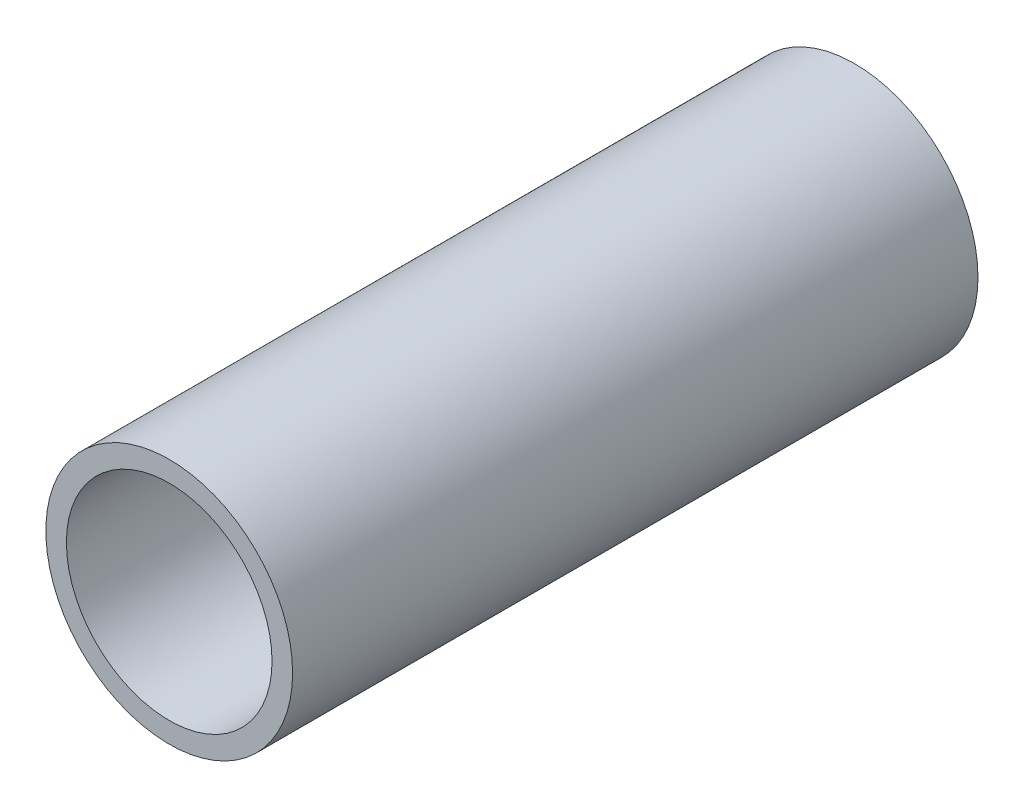
ISO-10303-21;
HEADER;
FILE_DESCRIPTION(('STEP AP214'),'2;1');
FILE_NAME('part.step','',(''),(''),'','','');
FILE_SCHEMA(('AUTOMOTIVE_DESIGN { 1 0 10303 214 1 1 1 1 }'));
ENDSEC;
DATA;
#1=APPLICATION_CONTEXT('core data for automotive mechanical design processes');
#2=APPLICATION_PROTOCOL_DEFINITION('international standard','automotive_design',2000,#1);
#3=PRODUCT_CONTEXT('',#1,'mechanical');
#4=PRODUCT('Part','Part','',(#3));
#5=PRODUCT_RELATED_PRODUCT_CATEGORY('part','',(#4));
#6=PRODUCT_DEFINITION_FORMATION('','',#4);
#7=PRODUCT_DEFINITION_CONTEXT('part definition',#1,'design');
#8=PRODUCT_DEFINITION('design','',#6,#7);
#9=PRODUCT_DEFINITION_SHAPE('','',#8);
#10=(LENGTH_UNIT() NAMED_UNIT(*) SI_UNIT(.MILLI.,.METRE.));
#11=(NAMED_UNIT(*) PLANE_ANGLE_UNIT() SI_UNIT($,.RADIAN.));
#12=(NAMED_UNIT(*) SI_UNIT($,.STERADIAN.) SOLID_ANGLE_UNIT());
#13=UNCERTAINTY_MEASURE_WITH_UNIT(LENGTH_MEASURE(1.E-05),#10,'distance_accuracy_value','');
#14=(GEOMETRIC_REPRESENTATION_CONTEXT(3) GLOBAL_UNCERTAINTY_ASSIGNED_CONTEXT((#13)) GLOBAL_UNIT_ASSIGNED_CONTEXT((#10,
#11,#12)) REPRESENTATION_CONTEXT('',''));
#15=CARTESIAN_POINT('',(0.,0.,0.));
#16=DIRECTION('',(0.,0.,1.));
#17=DIRECTION('',(1.,0.,0.));
#18=AXIS2_PLACEMENT_3D('',#15,#16,#17);
#19=CARTESIAN_POINT('',(0.,0.,100.));
#20=DIRECTION('',(0.,0.,1.));
#21=DIRECTION('',(1.,0.,0.));
#22=AXIS2_PLACEMENT_3D('',#19,#20,#21);
#23=PLANE('',#22);
#24=CARTESIAN_POINT('',(0.,0.,100.));
#25=DIRECTION('',(0.,0.,1.));
#26=DIRECTION('',(1.,0.,0.));
#27=AXIS2_PLACEMENT_3D('',#24,#25,#26);
#28=CIRCLE('',#27,18.);
#29=CARTESIAN_POINT('',(18.,0.,100.));
#30=VERTEX_POINT('',#29);
#31=EDGE_CURVE('E10',#30,#30,#28,.T.);
#32=ORIENTED_EDGE('',*,*,#31,.T.);
#33=EDGE_LOOP('',(#32));
#34=FACE_BOUND('',#33,.T.);
#35=CARTESIAN_POINT('',(0.,0.,100.));
#36=DIRECTION('',(0.,0.,1.));
#37=DIRECTION('',(1.,0.,0.));
#38=AXIS2_PLACEMENT_3D('',#35,#36,#37);
#39=CIRCLE('',#38,15.);
#40=CARTESIAN_POINT('',(15.,0.,100.));
#41=VERTEX_POINT('',#40);
#42=EDGE_CURVE('E42',#41,#41,#39,.T.);
#43=ORIENTED_EDGE('',*,*,#42,.F.);
#44=EDGE_LOOP('',(#43));
#45=FACE_BOUND('',#44,.T.);
#46=ADVANCED_FACE('F31',(#34,#45),#23,.T.);
#47=CARTESIAN_POINT('',(0.,0.,0.));
#48=DIRECTION('',(0.,0.,1.));
#49=DIRECTION('',(1.,0.,0.));
#50=AXIS2_PLACEMENT_3D('',#47,#48,#49);
#51=PLANE('',#50);
#52=CARTESIAN_POINT('',(0.,0.,0.));
#53=DIRECTION('',(0.,0.,1.));
#54=DIRECTION('',(1.,0.,0.));
#55=AXIS2_PLACEMENT_3D('',#52,#53,#54);
#56=CIRCLE('',#55,18.);
#57=CARTESIAN_POINT('',(18.,0.,0.));
#58=VERTEX_POINT('',#57);
#59=EDGE_CURVE('E35',#58,#58,#56,.T.);
#60=ORIENTED_EDGE('',*,*,#59,.F.);
#61=EDGE_LOOP('',(#60));
#62=FACE_BOUND('',#61,.T.);
#63=CARTESIAN_POINT('',(0.,0.,0.));
#64=DIRECTION('',(0.,0.,1.));
#65=DIRECTION('',(1.,0.,0.));
#66=AXIS2_PLACEMENT_3D('',#63,#64,#65);
#67=CIRCLE('',#66,15.);
#68=CARTESIAN_POINT('',(15.,0.,0.));
#69=VERTEX_POINT('',#68);
#70=EDGE_CURVE('E44',#69,#69,#67,.T.);
#71=ORIENTED_EDGE('',*,*,#70,.T.);
#72=EDGE_LOOP('',(#71));
#73=FACE_BOUND('',#72,.T.);
#74=ADVANCED_FACE('F54',(#62,#73),#51,.F.);
#75=CARTESIAN_POINT('',(0.,0.,100.));
#76=DIRECTION('',(0.,0.,-1.));
#77=DIRECTION('',(-1.,0.,0.));
#78=AXIS2_PLACEMENT_3D('',#75,#76,#77);
#79=CYLINDRICAL_SURFACE('',#78,18.);
#80=ORIENTED_EDGE('',*,*,#31,.F.);
#81=EDGE_LOOP('',(#80));
#82=FACE_BOUND('',#81,.T.);
#83=ORIENTED_EDGE('',*,*,#59,.T.);
#84=EDGE_LOOP('',(#83));
#85=FACE_BOUND('',#84,.T.);
#86=ADVANCED_FACE('F33',(#82,#85),#79,.T.);
#87=CARTESIAN_POINT('',(0.,0.,100.));
#88=DIRECTION('',(0.,0.,-1.));
#89=DIRECTION('',(-1.,0.,0.));
#90=AXIS2_PLACEMENT_3D('',#87,#88,#89);
#91=CYLINDRICAL_SURFACE('',#90,15.);
#92=ORIENTED_EDGE('',*,*,#42,.T.);
#93=EDGE_LOOP('',(#92));
#94=FACE_BOUND('',#93,.T.);
#95=ORIENTED_EDGE('',*,*,#70,.F.);
#96=EDGE_LOOP('',(#95));
#97=FACE_BOUND('',#96,.T.);
#98=ADVANCED_FACE('F50',(#94,#97),#91,.F.);
#99=CLOSED_SHELL('',(#46,#74,#86,#98));
#100=MANIFOLD_SOLID_BREP('B2',#99);
#101=ADVANCED_BREP_SHAPE_REPRESENTATION('',(#18,#100),#14);
#102=SHAPE_DEFINITION_REPRESENTATION(#9,#101);
ENDSEC;
END-ISO-10303-21;
